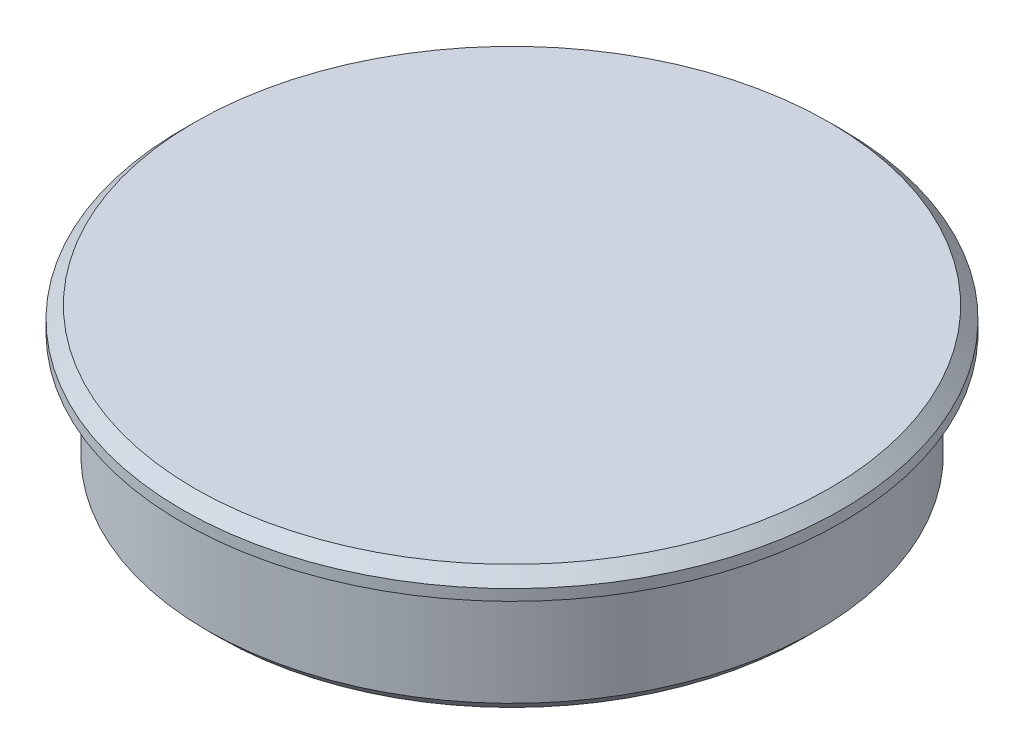
ISO-10303-21;
HEADER;
FILE_DESCRIPTION(('STEP AP214'),'2;1');
FILE_NAME('part.step','',(''),(''),'','','');
FILE_SCHEMA(('AUTOMOTIVE_DESIGN { 1 0 10303 214 1 1 1 1 }'));
ENDSEC;
DATA;
#1=APPLICATION_CONTEXT('core data for automotive mechanical design processes');
#2=APPLICATION_PROTOCOL_DEFINITION('international standard','automotive_design',2000,#1);
#3=PRODUCT_CONTEXT('',#1,'mechanical');
#4=PRODUCT('Part','Part','',(#3));
#5=PRODUCT_RELATED_PRODUCT_CATEGORY('part','',(#4));
#6=PRODUCT_DEFINITION_FORMATION('','',#4);
#7=PRODUCT_DEFINITION_CONTEXT('part definition',#1,'design');
#8=PRODUCT_DEFINITION('design','',#6,#7);
#9=PRODUCT_DEFINITION_SHAPE('','',#8);
#10=(LENGTH_UNIT() NAMED_UNIT(*) SI_UNIT(.MILLI.,.METRE.));
#11=(NAMED_UNIT(*) PLANE_ANGLE_UNIT() SI_UNIT($,.RADIAN.));
#12=(NAMED_UNIT(*) SI_UNIT($,.STERADIAN.) SOLID_ANGLE_UNIT());
#13=UNCERTAINTY_MEASURE_WITH_UNIT(LENGTH_MEASURE(1.E-05),#10,'distance_accuracy_value','');
#14=(GEOMETRIC_REPRESENTATION_CONTEXT(3) GLOBAL_UNCERTAINTY_ASSIGNED_CONTEXT((#13)) GLOBAL_UNIT_ASSIGNED_CONTEXT((#10,
#11,#12)) REPRESENTATION_CONTEXT('',''));
#15=CARTESIAN_POINT('',(0.,0.,0.));
#16=DIRECTION('',(0.,0.,1.));
#17=DIRECTION('',(1.,0.,0.));
#18=AXIS2_PLACEMENT_3D('',#15,#16,#17);
#19=CARTESIAN_POINT('',(0.,2.,0.));
#20=DIRECTION('',(0.,1.,0.));
#21=DIRECTION('',(0.,0.,1.));
#22=AXIS2_PLACEMENT_3D('',#19,#20,#21);
#23=PLANE('',#22);
#24=CARTESIAN_POINT('',(0.,2.,0.));
#25=DIRECTION('',(0.,1.,0.));
#26=DIRECTION('',(0.,0.,1.));
#27=AXIS2_PLACEMENT_3D('',#24,#25,#26);
#28=CIRCLE('',#27,12.9079);
#29=CARTESIAN_POINT('',(0.,2.,12.9079));
#30=VERTEX_POINT('',#29);
#31=EDGE_CURVE('E41',#30,#30,#28,.T.);
#32=ORIENTED_EDGE('',*,*,#31,.T.);
#33=EDGE_LOOP('',(#32));
#34=FACE_BOUND('',#33,.T.);
#35=ADVANCED_FACE('F30',(#34),#23,.T.);
#36=CARTESIAN_POINT('',(0.,0.,0.));
#37=DIRECTION('',(0.,-1.,0.));
#38=DIRECTION('',(0.,0.,-1.));
#39=AXIS2_PLACEMENT_3D('',#36,#37,#38);
#40=CYLINDRICAL_SURFACE('',#39,13.4079);
#41=CARTESIAN_POINT('',(0.,1.5,0.));
#42=DIRECTION('',(0.,1.,0.));
#43=DIRECTION('',(0.,0.,1.));
#44=AXIS2_PLACEMENT_3D('',#41,#42,#43);
#45=CIRCLE('',#44,13.4079);
#46=CARTESIAN_POINT('',(0.,1.5,13.4079));
#47=VERTEX_POINT('',#46);
#48=EDGE_CURVE('E45',#47,#47,#45,.F.);
#49=ORIENTED_EDGE('',*,*,#48,.T.);
#50=EDGE_LOOP('',(#49));
#51=FACE_BOUND('',#50,.T.);
#52=CARTESIAN_POINT('',(0.,1.05,0.));
#53=DIRECTION('',(0.,-1.,0.));
#54=DIRECTION('',(0.,0.,-1.));
#55=AXIS2_PLACEMENT_3D('',#52,#53,#54);
#56=CIRCLE('',#55,13.4079);
#57=CARTESIAN_POINT('',(0.,1.05,-13.4079));
#58=VERTEX_POINT('',#57);
#59=EDGE_CURVE('E50',#58,#58,#56,.T.);
#60=ORIENTED_EDGE('',*,*,#59,.F.);
#61=EDGE_LOOP('',(#60));
#62=FACE_BOUND('',#61,.T.);
#63=ADVANCED_FACE('F79',(#51,#62),#40,.T.);
#64=CARTESIAN_POINT('',(13.4079,1.05,0.));
#65=DIRECTION('',(0.,-1.,0.));
#66=DIRECTION('',(0.,0.,-1.));
#67=AXIS2_PLACEMENT_3D('',#64,#65,#66);
#68=PLANE('',#67);
#69=ORIENTED_EDGE('',*,*,#59,.T.);
#70=EDGE_LOOP('',(#69));
#71=FACE_BOUND('',#70,.T.);
#72=CARTESIAN_POINT('',(0.,1.05,0.));
#73=DIRECTION('',(0.,-1.,0.));
#74=DIRECTION('',(0.,0.,-1.));
#75=AXIS2_PLACEMENT_3D('',#72,#73,#74);
#76=CIRCLE('',#75,12.4079);
#77=CARTESIAN_POINT('',(0.,1.05,-12.4079));
#78=VERTEX_POINT('',#77);
#79=EDGE_CURVE('E53',#78,#78,#76,.T.);
#80=ORIENTED_EDGE('',*,*,#79,.F.);
#81=EDGE_LOOP('',(#80));
#82=FACE_BOUND('',#81,.T.);
#83=ADVANCED_FACE('F85',(#71,#82),#68,.T.);
#84=CARTESIAN_POINT('',(0.,0.,0.));
#85=DIRECTION('',(0.,-1.,0.));
#86=DIRECTION('',(0.,0.,-1.));
#87=AXIS2_PLACEMENT_3D('',#84,#85,#86);
#88=CYLINDRICAL_SURFACE('',#87,12.4079);
#89=CARTESIAN_POINT('',(0.,-3.25,0.));
#90=DIRECTION('',(0.,-1.,0.));
#91=DIRECTION('',(0.,0.,-1.));
#92=AXIS2_PLACEMENT_3D('',#89,#90,#91);
#93=CIRCLE('',#92,12.4079);
#94=CARTESIAN_POINT('',(0.,-3.25,-12.4079));
#95=VERTEX_POINT('',#94);
#96=EDGE_CURVE('E10',#95,#95,#93,.F.);
#97=ORIENTED_EDGE('',*,*,#96,.T.);
#98=EDGE_LOOP('',(#97));
#99=FACE_BOUND('',#98,.T.);
#100=ORIENTED_EDGE('',*,*,#79,.T.);
#101=EDGE_LOOP('',(#100));
#102=FACE_BOUND('',#101,.T.);
#103=ADVANCED_FACE('F76',(#99,#102),#88,.T.);
#104=CARTESIAN_POINT('',(12.4079,-3.75,0.));
#105=DIRECTION('',(0.,-1.,0.));
#106=DIRECTION('',(0.,0.,-1.));
#107=AXIS2_PLACEMENT_3D('',#104,#105,#106);
#108=PLANE('',#107);
#109=CARTESIAN_POINT('',(0.,-3.75,0.));
#110=DIRECTION('',(0.,-1.,0.));
#111=DIRECTION('',(0.,0.,-1.));
#112=AXIS2_PLACEMENT_3D('',#109,#110,#111);
#113=CIRCLE('',#112,11.9079);
#114=CARTESIAN_POINT('',(0.,-3.75,-11.9079));
#115=VERTEX_POINT('',#114);
#116=EDGE_CURVE('E37',#115,#115,#113,.T.);
#117=ORIENTED_EDGE('',*,*,#116,.T.);
#118=EDGE_LOOP('',(#117));
#119=FACE_BOUND('',#118,.T.);
#120=CARTESIAN_POINT('',(0.,-3.75,0.));
#121=DIRECTION('',(0.,-1.,0.));
#122=DIRECTION('',(0.,0.,-1.));
#123=AXIS2_PLACEMENT_3D('',#120,#121,#122);
#124=CIRCLE('',#123,10.4079);
#125=CARTESIAN_POINT('',(0.,-3.75,-10.4079));
#126=VERTEX_POINT('',#125);
#127=EDGE_CURVE('E56',#126,#126,#124,.T.);
#128=ORIENTED_EDGE('',*,*,#127,.F.);
#129=EDGE_LOOP('',(#128));
#130=FACE_BOUND('',#129,.T.);
#131=ADVANCED_FACE('F67',(#119,#130),#108,.T.);
#132=CARTESIAN_POINT('',(0.,0.,0.));
#133=DIRECTION('',(0.,-1.,0.));
#134=DIRECTION('',(0.,0.,-1.));
#135=AXIS2_PLACEMENT_3D('',#132,#133,#134);
#136=CYLINDRICAL_SURFACE('',#135,10.4079);
#137=ORIENTED_EDGE('',*,*,#127,.T.);
#138=EDGE_LOOP('',(#137));
#139=FACE_BOUND('',#138,.T.);
#140=CARTESIAN_POINT('',(0.,0.,0.));
#141=DIRECTION('',(0.,-1.,0.));
#142=DIRECTION('',(0.,0.,-1.));
#143=AXIS2_PLACEMENT_3D('',#140,#141,#142);
#144=CIRCLE('',#143,10.4079);
#145=CARTESIAN_POINT('',(0.,0.,-10.4079));
#146=VERTEX_POINT('',#145);
#147=EDGE_CURVE('E59',#146,#146,#144,.T.);
#148=ORIENTED_EDGE('',*,*,#147,.F.);
#149=EDGE_LOOP('',(#148));
#150=FACE_BOUND('',#149,.T.);
#151=ADVANCED_FACE('F65',(#139,#150),#136,.F.);
#152=CARTESIAN_POINT('',(10.4079,0.,0.));
#153=DIRECTION('',(0.,-1.,0.));
#154=DIRECTION('',(0.,0.,-1.));
#155=AXIS2_PLACEMENT_3D('',#152,#153,#154);
#156=PLANE('',#155);
#157=ORIENTED_EDGE('',*,*,#147,.T.);
#158=EDGE_LOOP('',(#157));
#159=FACE_BOUND('',#158,.T.);
#160=ADVANCED_FACE('F63',(#159),#156,.T.);
#161=CARTESIAN_POINT('',(0.,1.5,0.));
#162=DIRECTION('',(0.,-1.,0.));
#163=DIRECTION('',(0.,0.,-1.));
#164=AXIS2_PLACEMENT_3D('',#161,#162,#163);
#165=CONICAL_SURFACE('',#164,13.4079,0.785398163397448);
#166=ORIENTED_EDGE('',*,*,#31,.F.);
#167=EDGE_LOOP('',(#166));
#168=FACE_BOUND('',#167,.T.);
#169=ORIENTED_EDGE('',*,*,#48,.F.);
#170=EDGE_LOOP('',(#169));
#171=FACE_BOUND('',#170,.T.);
#172=ADVANCED_FACE('F74',(#168,#171),#165,.T.);
#173=CARTESIAN_POINT('',(0.,-3.75,0.));
#174=DIRECTION('',(0.,1.,0.));
#175=DIRECTION('',(0.,0.,1.));
#176=AXIS2_PLACEMENT_3D('',#173,#174,#175);
#177=CONICAL_SURFACE('',#176,11.9079,0.785398163397448);
#178=ORIENTED_EDGE('',*,*,#96,.F.);
#179=EDGE_LOOP('',(#178));
#180=FACE_BOUND('',#179,.T.);
#181=ORIENTED_EDGE('',*,*,#116,.F.);
#182=EDGE_LOOP('',(#181));
#183=FACE_BOUND('',#182,.T.);
#184=ADVANCED_FACE('F32',(#180,#183),#177,.T.);
#185=CLOSED_SHELL('',(#35,#63,#83,#103,#131,#151,#160,#172,#184));
#186=MANIFOLD_SOLID_BREP('B2',#185);
#187=ADVANCED_BREP_SHAPE_REPRESENTATION('',(#18,#186),#14);
#188=SHAPE_DEFINITION_REPRESENTATION(#9,#187);
ENDSEC;
END-ISO-10303-21;
